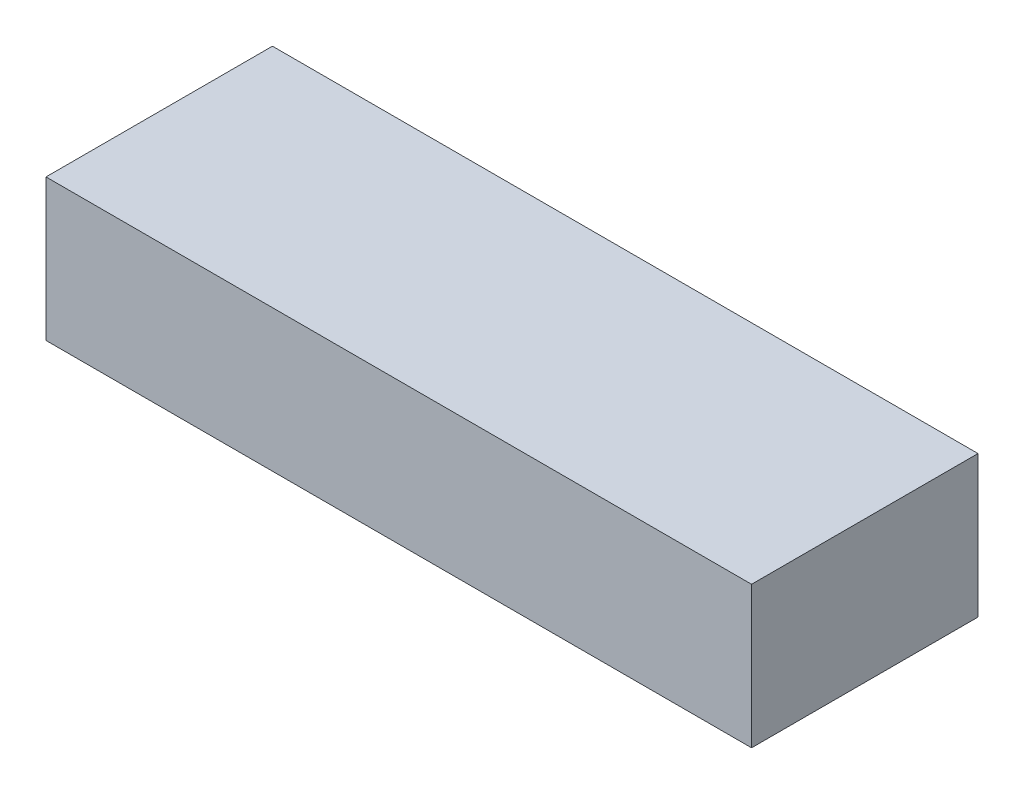
ISO-10303-21;
HEADER;
FILE_DESCRIPTION(('STEP AP214'),'2;1');
FILE_NAME('part.step','',(''),(''),'','','');
FILE_SCHEMA(('AUTOMOTIVE_DESIGN { 1 0 10303 214 1 1 1 1 }'));
ENDSEC;
DATA;
#1=APPLICATION_CONTEXT('core data for automotive mechanical design processes');
#2=APPLICATION_PROTOCOL_DEFINITION('international standard','automotive_design',2000,#1);
#3=PRODUCT_CONTEXT('',#1,'mechanical');
#4=PRODUCT('Part','Part','',(#3));
#5=PRODUCT_RELATED_PRODUCT_CATEGORY('part','',(#4));
#6=PRODUCT_DEFINITION_FORMATION('','',#4);
#7=PRODUCT_DEFINITION_CONTEXT('part definition',#1,'design');
#8=PRODUCT_DEFINITION('design','',#6,#7);
#9=PRODUCT_DEFINITION_SHAPE('','',#8);
#10=(LENGTH_UNIT() NAMED_UNIT(*) SI_UNIT(.MILLI.,.METRE.));
#11=(NAMED_UNIT(*) PLANE_ANGLE_UNIT() SI_UNIT($,.RADIAN.));
#12=(NAMED_UNIT(*) SI_UNIT($,.STERADIAN.) SOLID_ANGLE_UNIT());
#13=UNCERTAINTY_MEASURE_WITH_UNIT(LENGTH_MEASURE(1.E-05),#10,'distance_accuracy_value','');
#14=(GEOMETRIC_REPRESENTATION_CONTEXT(3) GLOBAL_UNCERTAINTY_ASSIGNED_CONTEXT((#13)) GLOBAL_UNIT_ASSIGNED_CONTEXT((#10,
#11,#12)) REPRESENTATION_CONTEXT('',''));
#15=CARTESIAN_POINT('',(0.,0.,0.));
#16=DIRECTION('',(0.,0.,1.));
#17=DIRECTION('',(1.,0.,0.));
#18=AXIS2_PLACEMENT_3D('',#15,#16,#17);
#19=CARTESIAN_POINT('',(-34.6752243089971,21.45,-9.72418964431767));
#20=DIRECTION('',(1.,0.,0.));
#21=DIRECTION('',(0.,0.,-1.));
#22=AXIS2_PLACEMENT_3D('',#19,#20,#21);
#23=PLANE('',#22);
#24=DIRECTION('',(0.,0.,1.));
#25=VECTOR('',#24,1.);
#26=CARTESIAN_POINT('',(-34.6752243089971,0.,-9.72418964431767));
#27=LINE('',#26,#25);
#28=CARTESIAN_POINT('',(-34.6752243089971,0.,-9.72418964431767));
#29=VERTEX_POINT('',#28);
#30=CARTESIAN_POINT('',(-34.6752243089971,0.,24.5658103556823));
#31=VERTEX_POINT('',#30);
#32=EDGE_CURVE('E96',#29,#31,#27,.T.);
#33=ORIENTED_EDGE('',*,*,#32,.T.);
#34=DIRECTION('',(0.,-1.,0.));
#35=VECTOR('',#34,1.);
#36=CARTESIAN_POINT('',(-34.6752243089971,21.45,24.5658103556823));
#37=LINE('',#36,#35);
#38=CARTESIAN_POINT('',(-34.6752243089971,21.45,24.5658103556823));
#39=VERTEX_POINT('',#38);
#40=EDGE_CURVE('E11',#39,#31,#37,.T.);
#41=ORIENTED_EDGE('',*,*,#40,.F.);
#42=DIRECTION('',(0.,0.,1.));
#43=VECTOR('',#42,1.);
#44=CARTESIAN_POINT('',(-34.6752243089971,21.45,-9.72418964431767));
#45=LINE('',#44,#43);
#46=CARTESIAN_POINT('',(-34.6752243089971,21.45,-9.72418964431767));
#47=VERTEX_POINT('',#46);
#48=EDGE_CURVE('E84',#47,#39,#45,.T.);
#49=ORIENTED_EDGE('',*,*,#48,.F.);
#50=DIRECTION('',(0.,-1.,0.));
#51=VECTOR('',#50,1.);
#52=CARTESIAN_POINT('',(-34.6752243089971,21.45,-9.72418964431767));
#53=LINE('',#52,#51);
#54=EDGE_CURVE('E92',#47,#29,#53,.T.);
#55=ORIENTED_EDGE('',*,*,#54,.T.);
#56=EDGE_LOOP('',(#33,#41,#49,#55));
#57=FACE_BOUND('',#56,.T.);
#58=ADVANCED_FACE('F33',(#57),#23,.F.);
#59=CARTESIAN_POINT('',(-34.6752243089971,21.45,24.5658103556823));
#60=DIRECTION('',(0.,0.,-1.));
#61=DIRECTION('',(-1.,0.,0.));
#62=AXIS2_PLACEMENT_3D('',#59,#60,#61);
#63=PLANE('',#62);
#64=DIRECTION('',(1.,0.,0.));
#65=VECTOR('',#64,1.);
#66=CARTESIAN_POINT('',(-34.6752243089971,0.,24.5658103556823));
#67=LINE('',#66,#65);
#68=CARTESIAN_POINT('',(72.1647756910029,0.,24.5658103556823));
#69=VERTEX_POINT('',#68);
#70=EDGE_CURVE('E88',#31,#69,#67,.T.);
#71=ORIENTED_EDGE('',*,*,#70,.T.);
#72=DIRECTION('',(0.,-1.,0.));
#73=VECTOR('',#72,1.);
#74=CARTESIAN_POINT('',(72.1647756910029,21.45,24.5658103556823));
#75=LINE('',#74,#73);
#76=CARTESIAN_POINT('',(72.1647756910029,21.45,24.5658103556823));
#77=VERTEX_POINT('',#76);
#78=EDGE_CURVE('E41',#77,#69,#75,.T.);
#79=ORIENTED_EDGE('',*,*,#78,.F.);
#80=DIRECTION('',(1.,0.,0.));
#81=VECTOR('',#80,1.);
#82=CARTESIAN_POINT('',(-34.6752243089971,21.45,24.5658103556823));
#83=LINE('',#82,#81);
#84=EDGE_CURVE('E79',#39,#77,#83,.T.);
#85=ORIENTED_EDGE('',*,*,#84,.F.);
#86=ORIENTED_EDGE('',*,*,#40,.T.);
#87=EDGE_LOOP('',(#71,#79,#85,#86));
#88=FACE_BOUND('',#87,.T.);
#89=ADVANCED_FACE('F87',(#88),#63,.F.);
#90=CARTESIAN_POINT('',(72.1647756910029,21.45,-9.72418964431767));
#91=DIRECTION('',(-1.,0.,0.));
#92=DIRECTION('',(0.,0.,1.));
#93=AXIS2_PLACEMENT_3D('',#90,#91,#92);
#94=PLANE('',#93);
#95=DIRECTION('',(0.,0.,-1.));
#96=VECTOR('',#95,1.);
#97=CARTESIAN_POINT('',(72.1647756910029,0.,-9.72418964431767));
#98=LINE('',#97,#96);
#99=CARTESIAN_POINT('',(72.1647756910029,0.,-9.72418964431767));
#100=VERTEX_POINT('',#99);
#101=EDGE_CURVE('E66',#69,#100,#98,.T.);
#102=ORIENTED_EDGE('',*,*,#101,.T.);
#103=DIRECTION('',(0.,-1.,0.));
#104=VECTOR('',#103,1.);
#105=CARTESIAN_POINT('',(72.1647756910029,21.45,-9.72418964431767));
#106=LINE('',#105,#104);
#107=CARTESIAN_POINT('',(72.1647756910029,21.45,-9.72418964431767));
#108=VERTEX_POINT('',#107);
#109=EDGE_CURVE('E89',#108,#100,#106,.T.);
#110=ORIENTED_EDGE('',*,*,#109,.F.);
#111=DIRECTION('',(0.,0.,-1.));
#112=VECTOR('',#111,1.);
#113=CARTESIAN_POINT('',(72.1647756910029,21.45,-9.72418964431767));
#114=LINE('',#113,#112);
#115=EDGE_CURVE('E82',#77,#108,#114,.T.);
#116=ORIENTED_EDGE('',*,*,#115,.F.);
#117=ORIENTED_EDGE('',*,*,#78,.T.);
#118=EDGE_LOOP('',(#102,#110,#116,#117));
#119=FACE_BOUND('',#118,.T.);
#120=ADVANCED_FACE('F90',(#119),#94,.F.);
#121=CARTESIAN_POINT('',(-34.6752243089971,21.45,-9.72418964431767));
#122=DIRECTION('',(0.,0.,1.));
#123=DIRECTION('',(1.,0.,0.));
#124=AXIS2_PLACEMENT_3D('',#121,#122,#123);
#125=PLANE('',#124);
#126=DIRECTION('',(-1.,0.,0.));
#127=VECTOR('',#126,1.);
#128=CARTESIAN_POINT('',(-34.6752243089971,0.,-9.72418964431767));
#129=LINE('',#128,#127);
#130=EDGE_CURVE('E72',#100,#29,#129,.T.);
#131=ORIENTED_EDGE('',*,*,#130,.T.);
#132=ORIENTED_EDGE('',*,*,#54,.F.);
#133=DIRECTION('',(-1.,0.,0.));
#134=VECTOR('',#133,1.);
#135=CARTESIAN_POINT('',(-34.6752243089971,21.45,-9.72418964431767));
#136=LINE('',#135,#134);
#137=EDGE_CURVE('E49',#108,#47,#136,.T.);
#138=ORIENTED_EDGE('',*,*,#137,.F.);
#139=ORIENTED_EDGE('',*,*,#109,.T.);
#140=EDGE_LOOP('',(#131,#132,#138,#139));
#141=FACE_BOUND('',#140,.T.);
#142=ADVANCED_FACE('F103',(#141),#125,.F.);
#143=CARTESIAN_POINT('',(0.,21.45,0.));
#144=DIRECTION('',(0.,1.,0.));
#145=DIRECTION('',(0.,0.,1.));
#146=AXIS2_PLACEMENT_3D('',#143,#144,#145);
#147=PLANE('',#146);
#148=ORIENTED_EDGE('',*,*,#48,.T.);
#149=ORIENTED_EDGE('',*,*,#84,.T.);
#150=ORIENTED_EDGE('',*,*,#115,.T.);
#151=ORIENTED_EDGE('',*,*,#137,.T.);
#152=EDGE_LOOP('',(#148,#149,#150,#151));
#153=FACE_BOUND('',#152,.T.);
#154=ADVANCED_FACE('F80',(#153),#147,.T.);
#155=CARTESIAN_POINT('',(0.,0.,0.));
#156=DIRECTION('',(0.,1.,0.));
#157=DIRECTION('',(0.,0.,1.));
#158=AXIS2_PLACEMENT_3D('',#155,#156,#157);
#159=PLANE('',#158);
#160=ORIENTED_EDGE('',*,*,#32,.F.);
#161=ORIENTED_EDGE('',*,*,#130,.F.);
#162=ORIENTED_EDGE('',*,*,#101,.F.);
#163=ORIENTED_EDGE('',*,*,#70,.F.);
#164=EDGE_LOOP('',(#160,#161,#162,#163));
#165=FACE_BOUND('',#164,.T.);
#166=ADVANCED_FACE('F106',(#165),#159,.F.);
#167=CLOSED_SHELL('',(#58,#89,#120,#142,#154,#166));
#168=MANIFOLD_SOLID_BREP('B2',#167);
#169=ADVANCED_BREP_SHAPE_REPRESENTATION('',(#18,#168),#14);
#170=SHAPE_DEFINITION_REPRESENTATION(#9,#169);
ENDSEC;
END-ISO-10303-21;
